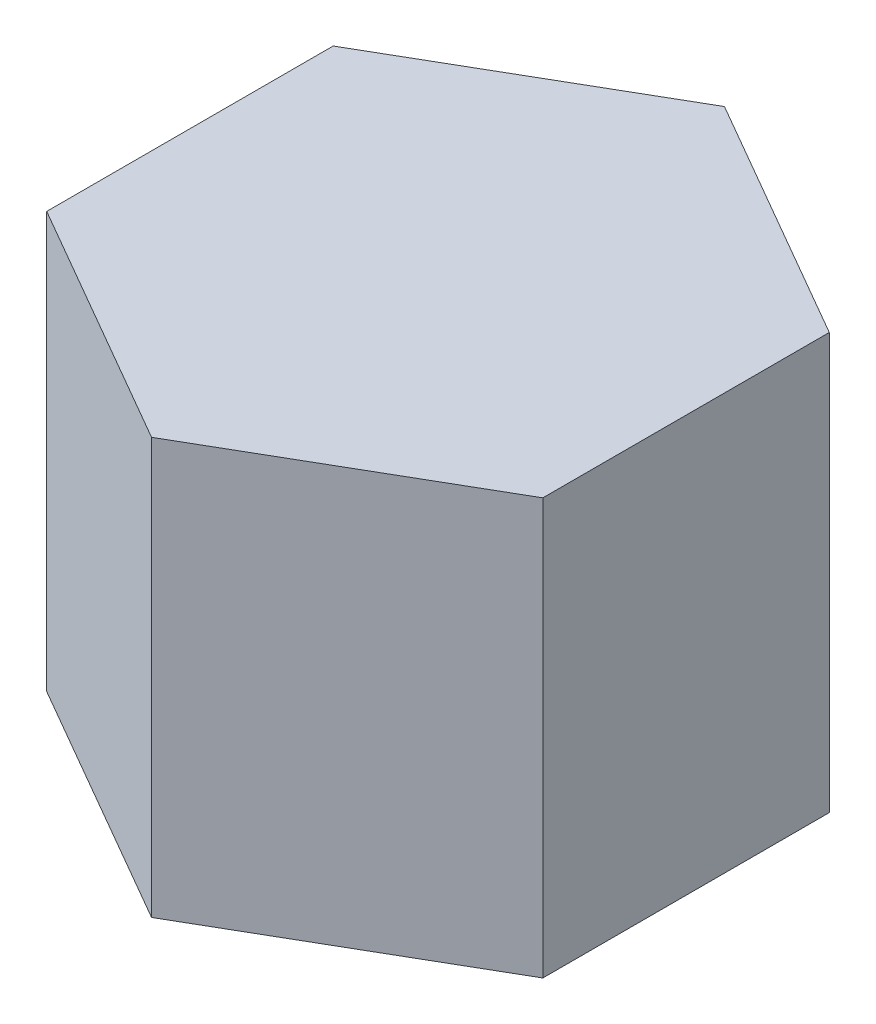
ISO-10303-21;
HEADER;
FILE_DESCRIPTION(('STEP AP214'),'2;1');
FILE_NAME('part.step','',(''),(''),'','','');
FILE_SCHEMA(('AUTOMOTIVE_DESIGN { 1 0 10303 214 1 1 1 1 }'));
ENDSEC;
DATA;
#1=APPLICATION_CONTEXT('core data for automotive mechanical design processes');
#2=APPLICATION_PROTOCOL_DEFINITION('international standard','automotive_design',2000,#1);
#3=PRODUCT_CONTEXT('',#1,'mechanical');
#4=PRODUCT('Part','Part','',(#3));
#5=PRODUCT_RELATED_PRODUCT_CATEGORY('part','',(#4));
#6=PRODUCT_DEFINITION_FORMATION('','',#4);
#7=PRODUCT_DEFINITION_CONTEXT('part definition',#1,'design');
#8=PRODUCT_DEFINITION('design','',#6,#7);
#9=PRODUCT_DEFINITION_SHAPE('','',#8);
#10=(LENGTH_UNIT() NAMED_UNIT(*) SI_UNIT(.MILLI.,.METRE.));
#11=(NAMED_UNIT(*) PLANE_ANGLE_UNIT() SI_UNIT($,.RADIAN.));
#12=(NAMED_UNIT(*) SI_UNIT($,.STERADIAN.) SOLID_ANGLE_UNIT());
#13=UNCERTAINTY_MEASURE_WITH_UNIT(LENGTH_MEASURE(1.E-05),#10,'distance_accuracy_value','');
#14=(GEOMETRIC_REPRESENTATION_CONTEXT(3) GLOBAL_UNCERTAINTY_ASSIGNED_CONTEXT((#13)) GLOBAL_UNIT_ASSIGNED_CONTEXT((#10,
#11,#12)) REPRESENTATION_CONTEXT('',''));
#15=CARTESIAN_POINT('',(0.,0.,0.));
#16=DIRECTION('',(0.,0.,1.));
#17=DIRECTION('',(1.,0.,0.));
#18=AXIS2_PLACEMENT_3D('',#15,#16,#17);
#19=CARTESIAN_POINT('',(209.142660308706,-148.537700895744,295.837098239417));
#20=DIRECTION('',(-0.499999999999909,0.,-0.866025403784491));
#21=DIRECTION('',(-0.866025403784491,0.,0.499999999999909));
#22=AXIS2_PLACEMENT_3D('',#19,#20,#21);
#23=PLANE('',#22);
#24=CARTESIAN_POINT('',(208.839551417381,-149.045793579175,296.012098239417));
#25=DIRECTION('',(0.866025403784491,0.,-0.499999999999909));
#26=VECTOR('',#25,1.);
#27=LINE('',#24,#26);
#28=CARTESIAN_POINT('',(208.839551417382,-149.045793579175,296.012098239417));
#29=VERTEX_POINT('',#28);
#30=CARTESIAN_POINT('',(209.142660308706,-149.045793579175,295.837098239417));
#31=VERTEX_POINT('',#30);
#32=EDGE_CURVE('E170',#29,#31,#27,.T.);
#33=ORIENTED_EDGE('',*,*,#32,.T.);
#34=CARTESIAN_POINT('',(209.142660308706,-148.537700895744,295.837098239417));
#35=DIRECTION('',(0.,-1.,0.));
#36=VECTOR('',#35,1.);
#37=LINE('',#34,#36);
#38=CARTESIAN_POINT('',(209.142660308706,-148.537700895744,295.837098239417));
#39=VERTEX_POINT('',#38);
#40=EDGE_CURVE('E35',#39,#31,#37,.T.);
#41=ORIENTED_EDGE('',*,*,#40,.F.);
#42=CARTESIAN_POINT('',(208.839551417381,-148.537700895744,296.012098239417));
#43=DIRECTION('',(0.866025403784491,0.,-0.499999999999909));
#44=VECTOR('',#43,1.);
#45=LINE('',#42,#44);
#46=CARTESIAN_POINT('',(208.839551417382,-148.537700895744,296.012098239417));
#47=VERTEX_POINT('',#46);
#48=EDGE_CURVE('E159',#47,#39,#45,.T.);
#49=ORIENTED_EDGE('',*,*,#48,.F.);
#50=CARTESIAN_POINT('',(208.839551417381,-148.537700895744,296.012098239417));
#51=DIRECTION('',(0.,-1.,0.));
#52=VECTOR('',#51,1.);
#53=LINE('',#50,#52);
#54=EDGE_CURVE('E10',#47,#29,#53,.T.);
#55=ORIENTED_EDGE('',*,*,#54,.T.);
#56=EDGE_LOOP('',(#33,#41,#49,#55));
#57=FACE_BOUND('',#56,.T.);
#58=ADVANCED_FACE('F16',(#57),#23,.F.);
#59=CARTESIAN_POINT('',(208.839551417382,-148.537700895744,296.012098239417));
#60=DIRECTION('',(0.500000000000062,0.,-0.866025403784403));
#61=DIRECTION('',(-0.866025403784403,0.,-0.500000000000062));
#62=AXIS2_PLACEMENT_3D('',#59,#60,#61);
#63=PLANE('',#62);
#64=CARTESIAN_POINT('',(208.536442526057,-149.045793579175,295.837098239417));
#65=DIRECTION('',(0.866025403784403,0.,0.500000000000062));
#66=VECTOR('',#65,1.);
#67=LINE('',#64,#66);
#68=CARTESIAN_POINT('',(208.536442526057,-149.045793579175,295.837098239417));
#69=VERTEX_POINT('',#68);
#70=EDGE_CURVE('E167',#69,#29,#67,.T.);
#71=ORIENTED_EDGE('',*,*,#70,.T.);
#72=ORIENTED_EDGE('',*,*,#54,.F.);
#73=CARTESIAN_POINT('',(208.536442526057,-148.537700895744,295.837098239417));
#74=DIRECTION('',(0.866025403784403,0.,0.500000000000062));
#75=VECTOR('',#74,1.);
#76=LINE('',#73,#75);
#77=CARTESIAN_POINT('',(208.536442526057,-148.537700895744,295.837098239417));
#78=VERTEX_POINT('',#77);
#79=EDGE_CURVE('E156',#78,#47,#76,.T.);
#80=ORIENTED_EDGE('',*,*,#79,.F.);
#81=CARTESIAN_POINT('',(208.536442526057,-148.537700895744,295.837098239417));
#82=DIRECTION('',(0.,-1.,0.));
#83=VECTOR('',#82,1.);
#84=LINE('',#81,#83);
#85=EDGE_CURVE('E27',#78,#69,#84,.T.);
#86=ORIENTED_EDGE('',*,*,#85,.T.);
#87=EDGE_LOOP('',(#71,#72,#80,#86));
#88=FACE_BOUND('',#87,.T.);
#89=ADVANCED_FACE('F189',(#88),#63,.F.);
#90=CARTESIAN_POINT('',(208.536442526057,-148.537700895744,290.831971220494));
#91=DIRECTION('',(1.,0.,0.));
#92=DIRECTION('',(0.,1.,0.));
#93=AXIS2_PLACEMENT_3D('',#90,#91,#92);
#94=PLANE('',#93);
#95=CARTESIAN_POINT('',(208.536442526057,-149.045793579175,295.487098239417));
#96=DIRECTION('',(0.,0.,1.));
#97=VECTOR('',#96,1.);
#98=LINE('',#95,#97);
#99=CARTESIAN_POINT('',(208.536442526057,-149.045793579175,295.487098239417));
#100=VERTEX_POINT('',#99);
#101=EDGE_CURVE('E163',#100,#69,#98,.T.);
#102=ORIENTED_EDGE('',*,*,#101,.T.);
#103=ORIENTED_EDGE('',*,*,#85,.F.);
#104=CARTESIAN_POINT('',(208.536442526057,-148.537700895744,295.487098239417));
#105=DIRECTION('',(0.,0.,1.));
#106=VECTOR('',#105,1.);
#107=LINE('',#104,#106);
#108=CARTESIAN_POINT('',(208.536442526057,-148.537700895744,295.487098239417));
#109=VERTEX_POINT('',#108);
#110=EDGE_CURVE('E106',#109,#78,#107,.T.);
#111=ORIENTED_EDGE('',*,*,#110,.F.);
#112=CARTESIAN_POINT('',(208.536442526057,-148.537700895744,295.487098239417));
#113=DIRECTION('',(0.,-1.,0.));
#114=VECTOR('',#113,1.);
#115=LINE('',#112,#114);
#116=EDGE_CURVE('E94',#109,#100,#115,.T.);
#117=ORIENTED_EDGE('',*,*,#116,.T.);
#118=EDGE_LOOP('',(#102,#103,#111,#117));
#119=FACE_BOUND('',#118,.T.);
#120=ADVANCED_FACE('F198',(#119),#94,.F.);
#121=CARTESIAN_POINT('',(208.536442526057,-148.537700895744,295.487098239417));
#122=DIRECTION('',(0.499999999999978,0.,0.866025403784452));
#123=DIRECTION('',(0.866025403784452,0.,-0.499999999999978));
#124=AXIS2_PLACEMENT_3D('',#121,#122,#123);
#125=PLANE('',#124);
#126=CARTESIAN_POINT('',(208.839551417382,-149.045793579175,295.312098239417));
#127=DIRECTION('',(-0.866025403784452,0.,0.499999999999978));
#128=VECTOR('',#127,1.);
#129=LINE('',#126,#128);
#130=CARTESIAN_POINT('',(208.839551417382,-149.045793579175,295.312098239417));
#131=VERTEX_POINT('',#130);
#132=EDGE_CURVE('E162',#131,#100,#129,.T.);
#133=ORIENTED_EDGE('',*,*,#132,.T.);
#134=ORIENTED_EDGE('',*,*,#116,.F.);
#135=CARTESIAN_POINT('',(208.839551417382,-148.537700895744,295.312098239417));
#136=DIRECTION('',(-0.866025403784452,0.,0.499999999999978));
#137=VECTOR('',#136,1.);
#138=LINE('',#135,#137);
#139=CARTESIAN_POINT('',(208.839551417382,-148.537700895744,295.312098239417));
#140=VERTEX_POINT('',#139);
#141=EDGE_CURVE('E98',#140,#109,#138,.T.);
#142=ORIENTED_EDGE('',*,*,#141,.F.);
#143=CARTESIAN_POINT('',(208.839551417382,-148.537700895744,295.312098239417));
#144=DIRECTION('',(0.,-1.,0.));
#145=VECTOR('',#144,1.);
#146=LINE('',#143,#145);
#147=EDGE_CURVE('E79',#140,#131,#146,.T.);
#148=ORIENTED_EDGE('',*,*,#147,.T.);
#149=EDGE_LOOP('',(#133,#134,#142,#148));
#150=FACE_BOUND('',#149,.T.);
#151=ADVANCED_FACE('F100',(#150),#125,.F.);
#152=CARTESIAN_POINT('',(208.839551417382,-148.537700895744,295.312098239417));
#153=DIRECTION('',(-0.500000000000062,0.,0.866025403784403));
#154=DIRECTION('',(0.866025403784403,0.,0.500000000000062));
#155=AXIS2_PLACEMENT_3D('',#152,#153,#154);
#156=PLANE('',#155);
#157=CARTESIAN_POINT('',(209.142660308706,-149.045793579175,295.487098239417));
#158=DIRECTION('',(-0.866025403784403,0.,-0.500000000000062));
#159=VECTOR('',#158,1.);
#160=LINE('',#157,#159);
#161=CARTESIAN_POINT('',(209.142660308706,-149.045793579175,295.487098239417));
#162=VERTEX_POINT('',#161);
#163=EDGE_CURVE('E88',#162,#131,#160,.T.);
#164=ORIENTED_EDGE('',*,*,#163,.T.);
#165=ORIENTED_EDGE('',*,*,#147,.F.);
#166=CARTESIAN_POINT('',(209.142660308706,-148.537700895744,295.487098239417));
#167=DIRECTION('',(-0.866025403784403,0.,-0.500000000000062));
#168=VECTOR('',#167,1.);
#169=LINE('',#166,#168);
#170=CARTESIAN_POINT('',(209.142660308706,-148.537700895744,295.487098239417));
#171=VERTEX_POINT('',#170);
#172=EDGE_CURVE('E84',#171,#140,#169,.T.);
#173=ORIENTED_EDGE('',*,*,#172,.F.);
#174=CARTESIAN_POINT('',(209.142660308706,-148.537700895744,295.487098239417));
#175=DIRECTION('',(0.,-1.,0.));
#176=VECTOR('',#175,1.);
#177=LINE('',#174,#176);
#178=EDGE_CURVE('E58',#171,#162,#177,.T.);
#179=ORIENTED_EDGE('',*,*,#178,.T.);
#180=EDGE_LOOP('',(#164,#165,#173,#179));
#181=FACE_BOUND('',#180,.T.);
#182=ADVANCED_FACE('F82',(#181),#156,.F.);
#183=CARTESIAN_POINT('',(209.142660308706,-148.537700895744,290.831971220494));
#184=DIRECTION('',(-1.,0.,0.));
#185=DIRECTION('',(0.,-1.,0.));
#186=AXIS2_PLACEMENT_3D('',#183,#184,#185);
#187=PLANE('',#186);
#188=CARTESIAN_POINT('',(209.142660308706,-149.045793579175,295.837098239417));
#189=DIRECTION('',(0.,0.,-1.));
#190=VECTOR('',#189,1.);
#191=LINE('',#188,#190);
#192=EDGE_CURVE('E160',#31,#162,#191,.T.);
#193=ORIENTED_EDGE('',*,*,#192,.T.);
#194=ORIENTED_EDGE('',*,*,#178,.F.);
#195=CARTESIAN_POINT('',(209.142660308706,-148.537700895744,295.837098239417));
#196=DIRECTION('',(0.,0.,-1.));
#197=VECTOR('',#196,1.);
#198=LINE('',#195,#197);
#199=EDGE_CURVE('E112',#39,#171,#198,.T.);
#200=ORIENTED_EDGE('',*,*,#199,.F.);
#201=ORIENTED_EDGE('',*,*,#40,.T.);
#202=EDGE_LOOP('',(#193,#194,#200,#201));
#203=FACE_BOUND('',#202,.T.);
#204=ADVANCED_FACE('F131',(#203),#187,.F.);
#205=CARTESIAN_POINT('',(206.339551417382,-148.537700895744,290.831971220494));
#206=DIRECTION('',(0.,-1.,0.));
#207=DIRECTION('',(1.,0.,0.));
#208=AXIS2_PLACEMENT_3D('',#205,#206,#207);
#209=PLANE('',#208);
#210=ORIENTED_EDGE('',*,*,#48,.T.);
#211=ORIENTED_EDGE('',*,*,#199,.T.);
#212=ORIENTED_EDGE('',*,*,#172,.T.);
#213=ORIENTED_EDGE('',*,*,#141,.T.);
#214=ORIENTED_EDGE('',*,*,#110,.T.);
#215=ORIENTED_EDGE('',*,*,#79,.T.);
#216=EDGE_LOOP('',(#210,#211,#212,#213,#214,#215));
#217=FACE_BOUND('',#216,.T.);
#218=ADVANCED_FACE('F111',(#217),#209,.F.);
#219=CARTESIAN_POINT('',(206.339551417382,-149.045793579175,290.831971220494));
#220=DIRECTION('',(0.,-1.,0.));
#221=DIRECTION('',(1.,0.,0.));
#222=AXIS2_PLACEMENT_3D('',#219,#220,#221);
#223=PLANE('',#222);
#224=ORIENTED_EDGE('',*,*,#32,.F.);
#225=ORIENTED_EDGE('',*,*,#70,.F.);
#226=ORIENTED_EDGE('',*,*,#101,.F.);
#227=ORIENTED_EDGE('',*,*,#132,.F.);
#228=ORIENTED_EDGE('',*,*,#163,.F.);
#229=ORIENTED_EDGE('',*,*,#192,.F.);
#230=EDGE_LOOP('',(#224,#225,#226,#227,#228,#229));
#231=FACE_BOUND('',#230,.T.);
#232=ADVANCED_FACE('F130',(#231),#223,.T.);
#233=CLOSED_SHELL('',(#58,#89,#120,#151,#182,#204,#218,#232));
#234=MANIFOLD_SOLID_BREP('B1',#233);
#235=ADVANCED_BREP_SHAPE_REPRESENTATION('',(#18,#234),#14);
#236=SHAPE_DEFINITION_REPRESENTATION(#9,#235);
ENDSEC;
END-ISO-10303-21;
